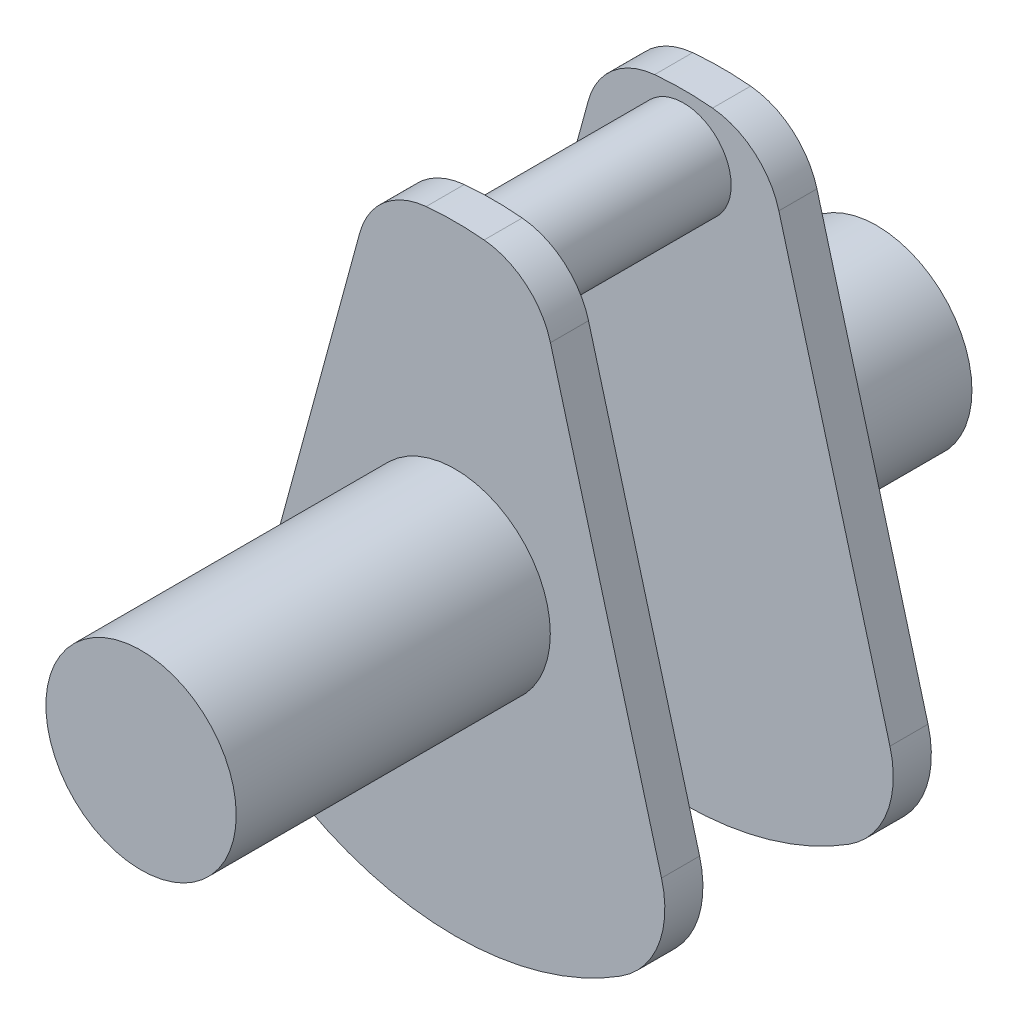
ISO-10303-21;
HEADER;
FILE_DESCRIPTION(('STEP AP214'),'2;1');
FILE_NAME('part.step','',(''),(''),'','','');
FILE_SCHEMA(('AUTOMOTIVE_DESIGN { 1 0 10303 214 1 1 1 1 }'));
ENDSEC;
DATA;
#1=APPLICATION_CONTEXT('core data for automotive mechanical design processes');
#2=APPLICATION_PROTOCOL_DEFINITION('international standard','automotive_design',2000,#1);
#3=PRODUCT_CONTEXT('',#1,'mechanical');
#4=PRODUCT('Part','Part','',(#3));
#5=PRODUCT_RELATED_PRODUCT_CATEGORY('part','',(#4));
#6=PRODUCT_DEFINITION_FORMATION('','',#4);
#7=PRODUCT_DEFINITION_CONTEXT('part definition',#1,'design');
#8=PRODUCT_DEFINITION('design','',#6,#7);
#9=PRODUCT_DEFINITION_SHAPE('','',#8);
#10=(LENGTH_UNIT() NAMED_UNIT(*) SI_UNIT(.MILLI.,.METRE.));
#11=(NAMED_UNIT(*) PLANE_ANGLE_UNIT() SI_UNIT($,.RADIAN.));
#12=(NAMED_UNIT(*) SI_UNIT($,.STERADIAN.) SOLID_ANGLE_UNIT());
#13=UNCERTAINTY_MEASURE_WITH_UNIT(LENGTH_MEASURE(1.E-05),#10,'distance_accuracy_value','');
#14=(GEOMETRIC_REPRESENTATION_CONTEXT(3) GLOBAL_UNCERTAINTY_ASSIGNED_CONTEXT((#13)) GLOBAL_UNIT_ASSIGNED_CONTEXT((#10,
#11,#12)) REPRESENTATION_CONTEXT('',''));
#15=CARTESIAN_POINT('',(0.,0.,0.));
#16=DIRECTION('',(0.,0.,1.));
#17=DIRECTION('',(1.,0.,0.));
#18=AXIS2_PLACEMENT_3D('',#15,#16,#17);
#19=CARTESIAN_POINT('',(0.459,4.87845457086565,0.8));
#20=DIRECTION('',(0.,0.,-1.));
#21=DIRECTION('',(-1.,0.,0.));
#22=AXIS2_PLACEMENT_3D('',#19,#20,#21);
#23=CYLINDRICAL_SURFACE('',#22,1.6);
#24=CARTESIAN_POINT('',(0.459,4.87845457086565,0.));
#25=DIRECTION('',(0.,0.,1.));
#26=DIRECTION('',(1.,0.,0.));
#27=AXIS2_PLACEMENT_3D('',#24,#25,#26);
#28=CIRCLE('',#27,1.6);
#29=CARTESIAN_POINT('',(2.00284320160388,5.29863092534255,0.));
#30=VERTEX_POINT('',#29);
#31=CARTESIAN_POINT('',(0.608877551020407,6.47141932869934,0.));
#32=VERTEX_POINT('',#31);
#33=EDGE_CURVE('E138',#30,#32,#28,.T.);
#34=ORIENTED_EDGE('',*,*,#33,.T.);
#35=DIRECTION('',(0.,0.,-1.));
#36=VECTOR('',#35,1.);
#37=CARTESIAN_POINT('',(0.608877551020407,6.47141932869934,0.8));
#38=LINE('',#37,#36);
#39=CARTESIAN_POINT('',(0.608877551020407,6.47141932869934,0.8));
#40=VERTEX_POINT('',#39);
#41=EDGE_CURVE('E45',#40,#32,#38,.T.);
#42=ORIENTED_EDGE('',*,*,#41,.F.);
#43=CARTESIAN_POINT('',(0.459,4.87845457086565,0.8));
#44=DIRECTION('',(0.,0.,1.));
#45=DIRECTION('',(1.,0.,0.));
#46=AXIS2_PLACEMENT_3D('',#43,#44,#45);
#47=CIRCLE('',#46,1.6);
#48=CARTESIAN_POINT('',(2.00284320160388,5.29863092534255,0.8));
#49=VERTEX_POINT('',#48);
#50=EDGE_CURVE('E153',#49,#40,#47,.T.);
#51=ORIENTED_EDGE('',*,*,#50,.F.);
#52=DIRECTION('',(0.,0.,-1.));
#53=VECTOR('',#52,1.);
#54=CARTESIAN_POINT('',(2.00284320160388,5.29863092534255,0.8));
#55=LINE('',#54,#53);
#56=EDGE_CURVE('E134',#49,#30,#55,.T.);
#57=ORIENTED_EDGE('',*,*,#56,.T.);
#58=EDGE_LOOP('',(#34,#42,#51,#57));
#59=FACE_BOUND('',#58,.T.);
#60=ADVANCED_FACE('F37',(#59),#23,.T.);
#61=CARTESIAN_POINT('',(0.,0.,0.8));
#62=DIRECTION('',(0.,0.,-1.));
#63=DIRECTION('',(-1.,0.,0.));
#64=AXIS2_PLACEMENT_3D('',#61,#62,#63);
#65=CYLINDRICAL_SURFACE('',#64,6.5);
#66=CARTESIAN_POINT('',(0.,0.,0.));
#67=DIRECTION('',(0.,0.,1.));
#68=DIRECTION('',(1.,0.,0.));
#69=AXIS2_PLACEMENT_3D('',#66,#67,#68);
#70=CIRCLE('',#69,6.5);
#71=CARTESIAN_POINT('',(-0.608877551020407,6.47141932869934,0.));
#72=VERTEX_POINT('',#71);
#73=EDGE_CURVE('E141',#32,#72,#70,.T.);
#74=ORIENTED_EDGE('',*,*,#73,.T.);
#75=DIRECTION('',(0.,0.,-1.));
#76=VECTOR('',#75,1.);
#77=CARTESIAN_POINT('',(-0.608877551020407,6.47141932869934,0.8));
#78=LINE('',#77,#76);
#79=CARTESIAN_POINT('',(-0.608877551020407,6.47141932869934,0.8));
#80=VERTEX_POINT('',#79);
#81=EDGE_CURVE('E163',#80,#72,#78,.T.);
#82=ORIENTED_EDGE('',*,*,#81,.F.);
#83=CARTESIAN_POINT('',(0.,0.,0.8));
#84=DIRECTION('',(0.,0.,1.));
#85=DIRECTION('',(1.,0.,0.));
#86=AXIS2_PLACEMENT_3D('',#83,#84,#85);
#87=CIRCLE('',#86,6.5);
#88=EDGE_CURVE('E98',#40,#80,#87,.T.);
#89=ORIENTED_EDGE('',*,*,#88,.F.);
#90=ORIENTED_EDGE('',*,*,#41,.T.);
#91=EDGE_LOOP('',(#74,#82,#89,#90));
#92=FACE_BOUND('',#91,.T.);
#93=ADVANCED_FACE('F166',(#92),#65,.T.);
#94=CARTESIAN_POINT('',(-0.459,4.87845457086565,0.8));
#95=DIRECTION('',(0.,0.,-1.));
#96=DIRECTION('',(-1.,0.,0.));
#97=AXIS2_PLACEMENT_3D('',#94,#95,#96);
#98=CYLINDRICAL_SURFACE('',#97,1.6);
#99=CARTESIAN_POINT('',(-0.459,4.87845457086565,0.));
#100=DIRECTION('',(0.,0.,1.));
#101=DIRECTION('',(-1.,0.,0.));
#102=AXIS2_PLACEMENT_3D('',#99,#100,#101);
#103=CIRCLE('',#102,1.6);
#104=CARTESIAN_POINT('',(-2.00284320160388,5.29863092534255,0.));
#105=VERTEX_POINT('',#104);
#106=EDGE_CURVE('E144',#72,#105,#103,.T.);
#107=ORIENTED_EDGE('',*,*,#106,.T.);
#108=DIRECTION('',(0.,0.,-1.));
#109=VECTOR('',#108,1.);
#110=CARTESIAN_POINT('',(-2.00284320160388,5.29863092534255,0.8));
#111=LINE('',#110,#109);
#112=CARTESIAN_POINT('',(-2.00284320160388,5.29863092534255,0.8));
#113=VERTEX_POINT('',#112);
#114=EDGE_CURVE('E160',#113,#105,#111,.T.);
#115=ORIENTED_EDGE('',*,*,#114,.F.);
#116=CARTESIAN_POINT('',(-0.459,4.87845457086565,0.8));
#117=DIRECTION('',(0.,0.,1.));
#118=DIRECTION('',(-1.,0.,0.));
#119=AXIS2_PLACEMENT_3D('',#116,#117,#118);
#120=CIRCLE('',#119,1.6);
#121=EDGE_CURVE('E184',#80,#113,#120,.T.);
#122=ORIENTED_EDGE('',*,*,#121,.F.);
#123=ORIENTED_EDGE('',*,*,#81,.T.);
#124=EDGE_LOOP('',(#107,#115,#122,#123));
#125=FACE_BOUND('',#124,.T.);
#126=ADVANCED_FACE('F177',(#125),#98,.T.);
#127=CARTESIAN_POINT('',(-2.00284320160388,5.29863092534255,0.8));
#128=DIRECTION('',(0.964902001002423,-0.26261022154806,0.));
#129=DIRECTION('',(0.26261022154806,0.964902001002423,0.));
#130=AXIS2_PLACEMENT_3D('',#127,#128,#129);
#131=PLANE('',#130);
#132=DIRECTION('',(-0.26261022154806,-0.964902001002422,0.));
#133=VECTOR('',#132,1.);
#134=CARTESIAN_POINT('',(-2.00284320160388,5.29863092534255,0.));
#135=LINE('',#134,#133);
#136=CARTESIAN_POINT('',(-4.33679216610228,-3.27693788841703,0.));
#137=VERTEX_POINT('',#136);
#138=EDGE_CURVE('E146',#105,#137,#135,.T.);
#139=ORIENTED_EDGE('',*,*,#138,.T.);
#140=DIRECTION('',(0.,0.,-1.));
#141=VECTOR('',#140,1.);
#142=CARTESIAN_POINT('',(-4.33679216610228,-3.27693788841703,0.8));
#143=LINE('',#142,#141);
#144=CARTESIAN_POINT('',(-4.33679216610228,-3.27693788841703,0.8));
#145=VERTEX_POINT('',#144);
#146=EDGE_CURVE('E157',#145,#137,#143,.T.);
#147=ORIENTED_EDGE('',*,*,#146,.F.);
#148=DIRECTION('',(-0.26261022154806,-0.964902001002422,0.));
#149=VECTOR('',#148,1.);
#150=CARTESIAN_POINT('',(-2.00284320160388,5.29863092534255,0.8));
#151=LINE('',#150,#149);
#152=EDGE_CURVE('E183',#113,#145,#151,.T.);
#153=ORIENTED_EDGE('',*,*,#152,.F.);
#154=ORIENTED_EDGE('',*,*,#114,.T.);
#155=EDGE_LOOP('',(#139,#147,#153,#154));
#156=FACE_BOUND('',#155,.T.);
#157=ADVANCED_FACE('F181',(#156),#131,.F.);
#158=CARTESIAN_POINT('',(-2.40698816409743,-3.80215833151315,0.8));
#159=DIRECTION('',(0.,0.,-1.));
#160=DIRECTION('',(-1.,0.,0.));
#161=AXIS2_PLACEMENT_3D('',#158,#159,#160);
#162=CYLINDRICAL_SURFACE('',#161,2.);
#163=CARTESIAN_POINT('',(-2.40698816409743,-3.80215833151315,0.));
#164=DIRECTION('',(0.,0.,1.));
#165=DIRECTION('',(1.,0.,0.));
#166=AXIS2_PLACEMENT_3D('',#163,#164,#165);
#167=CIRCLE('',#166,2.);
#168=CARTESIAN_POINT('',(-3.47676068147407,-5.49200647885233,0.));
#169=VERTEX_POINT('',#168);
#170=EDGE_CURVE('E148',#137,#169,#167,.T.);
#171=ORIENTED_EDGE('',*,*,#170,.T.);
#172=DIRECTION('',(0.,0.,-1.));
#173=VECTOR('',#172,1.);
#174=CARTESIAN_POINT('',(-3.47676068147407,-5.49200647885233,0.8));
#175=LINE('',#174,#173);
#176=CARTESIAN_POINT('',(-3.47676068147407,-5.49200647885233,0.8));
#177=VERTEX_POINT('',#176);
#178=EDGE_CURVE('E129',#177,#169,#175,.T.);
#179=ORIENTED_EDGE('',*,*,#178,.F.);
#180=CARTESIAN_POINT('',(-2.40698816409743,-3.80215833151315,0.8));
#181=DIRECTION('',(0.,0.,1.));
#182=DIRECTION('',(1.,0.,0.));
#183=AXIS2_PLACEMENT_3D('',#180,#181,#182);
#184=CIRCLE('',#183,2.);
#185=EDGE_CURVE('E120',#145,#177,#184,.T.);
#186=ORIENTED_EDGE('',*,*,#185,.F.);
#187=ORIENTED_EDGE('',*,*,#146,.T.);
#188=EDGE_LOOP('',(#171,#179,#186,#187));
#189=FACE_BOUND('',#188,.T.);
#190=ADVANCED_FACE('F307',(#189),#162,.T.);
#191=CARTESIAN_POINT('',(0.,0.,0.8));
#192=DIRECTION('',(0.,0.,-1.));
#193=DIRECTION('',(-1.,0.,0.));
#194=AXIS2_PLACEMENT_3D('',#191,#192,#193);
#195=CYLINDRICAL_SURFACE('',#194,6.5);
#196=CARTESIAN_POINT('',(0.,0.,0.));
#197=DIRECTION('',(0.,0.,1.));
#198=DIRECTION('',(1.,0.,0.));
#199=AXIS2_PLACEMENT_3D('',#196,#197,#198);
#200=CIRCLE('',#199,6.5);
#201=CARTESIAN_POINT('',(3.47676068147407,-5.49200647885233,0.));
#202=VERTEX_POINT('',#201);
#203=EDGE_CURVE('E128',#169,#202,#200,.T.);
#204=ORIENTED_EDGE('',*,*,#203,.T.);
#205=DIRECTION('',(0.,0.,-1.));
#206=VECTOR('',#205,1.);
#207=CARTESIAN_POINT('',(3.47676068147407,-5.49200647885233,0.8));
#208=LINE('',#207,#206);
#209=CARTESIAN_POINT('',(3.47676068147407,-5.49200647885233,0.8));
#210=VERTEX_POINT('',#209);
#211=EDGE_CURVE('E125',#210,#202,#208,.T.);
#212=ORIENTED_EDGE('',*,*,#211,.F.);
#213=CARTESIAN_POINT('',(0.,0.,0.8));
#214=DIRECTION('',(0.,0.,1.));
#215=DIRECTION('',(1.,0.,0.));
#216=AXIS2_PLACEMENT_3D('',#213,#214,#215);
#217=CIRCLE('',#216,6.5);
#218=EDGE_CURVE('E114',#177,#210,#217,.T.);
#219=ORIENTED_EDGE('',*,*,#218,.F.);
#220=ORIENTED_EDGE('',*,*,#178,.T.);
#221=EDGE_LOOP('',(#204,#212,#219,#220));
#222=FACE_BOUND('',#221,.T.);
#223=ADVANCED_FACE('F126',(#222),#195,.T.);
#224=CARTESIAN_POINT('',(2.40698816409743,-3.80215833151315,0.8));
#225=DIRECTION('',(0.,0.,-1.));
#226=DIRECTION('',(-1.,0.,0.));
#227=AXIS2_PLACEMENT_3D('',#224,#225,#226);
#228=CYLINDRICAL_SURFACE('',#227,2.);
#229=CARTESIAN_POINT('',(2.40698816409743,-3.80215833151315,0.));
#230=DIRECTION('',(0.,0.,1.));
#231=DIRECTION('',(1.,0.,0.));
#232=AXIS2_PLACEMENT_3D('',#229,#230,#231);
#233=CIRCLE('',#232,2.);
#234=CARTESIAN_POINT('',(4.33679216610228,-3.27693788841703,0.));
#235=VERTEX_POINT('',#234);
#236=EDGE_CURVE('E83',#202,#235,#233,.T.);
#237=ORIENTED_EDGE('',*,*,#236,.T.);
#238=DIRECTION('',(0.,0.,-1.));
#239=VECTOR('',#238,1.);
#240=CARTESIAN_POINT('',(4.33679216610228,-3.27693788841703,0.8));
#241=LINE('',#240,#239);
#242=CARTESIAN_POINT('',(4.33679216610228,-3.27693788841703,0.8));
#243=VERTEX_POINT('',#242);
#244=EDGE_CURVE('E130',#243,#235,#241,.T.);
#245=ORIENTED_EDGE('',*,*,#244,.F.);
#246=CARTESIAN_POINT('',(2.40698816409743,-3.80215833151315,0.8));
#247=DIRECTION('',(0.,0.,1.));
#248=DIRECTION('',(1.,0.,0.));
#249=AXIS2_PLACEMENT_3D('',#246,#247,#248);
#250=CIRCLE('',#249,2.);
#251=EDGE_CURVE('E118',#210,#243,#250,.T.);
#252=ORIENTED_EDGE('',*,*,#251,.F.);
#253=ORIENTED_EDGE('',*,*,#211,.T.);
#254=EDGE_LOOP('',(#237,#245,#252,#253));
#255=FACE_BOUND('',#254,.T.);
#256=ADVANCED_FACE('F132',(#255),#228,.T.);
#257=CARTESIAN_POINT('',(2.00284320160388,5.29863092534255,0.8));
#258=DIRECTION('',(-0.964902001002422,-0.26261022154806,0.));
#259=DIRECTION('',(0.26261022154806,-0.964902001002422,0.));
#260=AXIS2_PLACEMENT_3D('',#257,#258,#259);
#261=PLANE('',#260);
#262=DIRECTION('',(-0.26261022154806,0.964902001002422,0.));
#263=VECTOR('',#262,1.);
#264=CARTESIAN_POINT('',(2.00284320160388,5.29863092534255,0.));
#265=LINE('',#264,#263);
#266=EDGE_CURVE('E89',#235,#30,#265,.T.);
#267=ORIENTED_EDGE('',*,*,#266,.T.);
#268=ORIENTED_EDGE('',*,*,#56,.F.);
#269=DIRECTION('',(-0.26261022154806,0.964902001002422,0.));
#270=VECTOR('',#269,1.);
#271=CARTESIAN_POINT('',(2.00284320160388,5.29863092534255,0.8));
#272=LINE('',#271,#270);
#273=EDGE_CURVE('E53',#243,#49,#272,.T.);
#274=ORIENTED_EDGE('',*,*,#273,.F.);
#275=ORIENTED_EDGE('',*,*,#244,.T.);
#276=EDGE_LOOP('',(#267,#268,#274,#275));
#277=FACE_BOUND('',#276,.T.);
#278=ADVANCED_FACE('F315',(#277),#261,.F.);
#279=CARTESIAN_POINT('',(0.459,4.87845457086565,0.8));
#280=DIRECTION('',(0.,0.,1.));
#281=DIRECTION('',(1.,0.,0.));
#282=AXIS2_PLACEMENT_3D('',#279,#280,#281);
#283=PLANE('',#282);
#284=CARTESIAN_POINT('',(0.,5.26,0.8));
#285=DIRECTION('',(0.,0.,1.));
#286=DIRECTION('',(1.,0.,0.));
#287=AXIS2_PLACEMENT_3D('',#284,#285,#286);
#288=CIRCLE('',#287,1.);
#289=CARTESIAN_POINT('',(1.,5.26,0.8));
#290=VERTEX_POINT('',#289);
#291=EDGE_CURVE('E142',#290,#290,#288,.T.);
#292=ORIENTED_EDGE('',*,*,#291,.F.);
#293=EDGE_LOOP('',(#292));
#294=FACE_BOUND('',#293,.T.);
#295=ORIENTED_EDGE('',*,*,#50,.T.);
#296=ORIENTED_EDGE('',*,*,#88,.T.);
#297=ORIENTED_EDGE('',*,*,#121,.T.);
#298=ORIENTED_EDGE('',*,*,#152,.T.);
#299=ORIENTED_EDGE('',*,*,#185,.T.);
#300=ORIENTED_EDGE('',*,*,#218,.T.);
#301=ORIENTED_EDGE('',*,*,#251,.T.);
#302=ORIENTED_EDGE('',*,*,#273,.T.);
#303=EDGE_LOOP('',(#295,#296,#297,#298,#299,#300,#301,#302));
#304=FACE_BOUND('',#303,.T.);
#305=ADVANCED_FACE('F116',(#294,#304),#283,.T.);
#306=CARTESIAN_POINT('',(0.459,4.87845457086565,0.));
#307=DIRECTION('',(0.,0.,1.));
#308=DIRECTION('',(1.,0.,0.));
#309=AXIS2_PLACEMENT_3D('',#306,#307,#308);
#310=PLANE('',#309);
#311=CARTESIAN_POINT('',(0.,0.,0.));
#312=DIRECTION('',(0.,0.,1.));
#313=DIRECTION('',(1.,0.,0.));
#314=AXIS2_PLACEMENT_3D('',#311,#312,#313);
#315=CIRCLE('',#314,2.);
#316=CARTESIAN_POINT('',(2.,0.,0.));
#317=VERTEX_POINT('',#316);
#318=EDGE_CURVE('E11',#317,#317,#315,.F.);
#319=ORIENTED_EDGE('',*,*,#318,.F.);
#320=EDGE_LOOP('',(#319));
#321=FACE_BOUND('',#320,.T.);
#322=ORIENTED_EDGE('',*,*,#33,.F.);
#323=ORIENTED_EDGE('',*,*,#266,.F.);
#324=ORIENTED_EDGE('',*,*,#236,.F.);
#325=ORIENTED_EDGE('',*,*,#203,.F.);
#326=ORIENTED_EDGE('',*,*,#170,.F.);
#327=ORIENTED_EDGE('',*,*,#138,.F.);
#328=ORIENTED_EDGE('',*,*,#106,.F.);
#329=ORIENTED_EDGE('',*,*,#73,.F.);
#330=EDGE_LOOP('',(#322,#323,#324,#325,#326,#327,#328,#329));
#331=FACE_BOUND('',#330,.T.);
#332=ADVANCED_FACE('F171',(#321,#331),#310,.F.);
#333=CARTESIAN_POINT('',(0.,5.26,2.8));
#334=DIRECTION('',(0.,0.,-1.));
#335=DIRECTION('',(-1.,0.,0.));
#336=AXIS2_PLACEMENT_3D('',#333,#334,#335);
#337=CYLINDRICAL_SURFACE('',#336,1.);
#338=ORIENTED_EDGE('',*,*,#291,.T.);
#339=EDGE_LOOP('',(#338));
#340=FACE_BOUND('',#339,.T.);
#341=CARTESIAN_POINT('',(0.,5.26,4.8));
#342=DIRECTION('',(0.,0.,1.));
#343=DIRECTION('',(1.,0.,0.));
#344=AXIS2_PLACEMENT_3D('',#341,#342,#343);
#345=CIRCLE('',#344,1.);
#346=CARTESIAN_POINT('',(1.,5.26,4.8));
#347=VERTEX_POINT('',#346);
#348=EDGE_CURVE('E248',#347,#347,#345,.T.);
#349=ORIENTED_EDGE('',*,*,#348,.F.);
#350=EDGE_LOOP('',(#349));
#351=FACE_BOUND('',#350,.T.);
#352=ADVANCED_FACE('F320',(#340,#351),#337,.T.);
#353=CARTESIAN_POINT('',(0.,0.,-3.26));
#354=DIRECTION('',(0.,0.,1.));
#355=DIRECTION('',(1.,0.,0.));
#356=AXIS2_PLACEMENT_3D('',#353,#354,#355);
#357=CYLINDRICAL_SURFACE('',#356,2.);
#358=CARTESIAN_POINT('',(0.,0.,-3.26));
#359=DIRECTION('',(0.,0.,-1.));
#360=DIRECTION('',(-1.,0.,0.));
#361=AXIS2_PLACEMENT_3D('',#358,#359,#360);
#362=CIRCLE('',#361,2.);
#363=CARTESIAN_POINT('',(-2.,0.,-3.26));
#364=VERTEX_POINT('',#363);
#365=EDGE_CURVE('E192',#364,#364,#362,.T.);
#366=ORIENTED_EDGE('',*,*,#365,.F.);
#367=EDGE_LOOP('',(#366));
#368=FACE_BOUND('',#367,.T.);
#369=ORIENTED_EDGE('',*,*,#318,.T.);
#370=EDGE_LOOP('',(#369));
#371=FACE_BOUND('',#370,.T.);
#372=ADVANCED_FACE('F326',(#368,#371),#357,.T.);
#373=CARTESIAN_POINT('',(0.,0.,-3.26));
#374=DIRECTION('',(0.,0.,-1.));
#375=DIRECTION('',(-1.,0.,0.));
#376=AXIS2_PLACEMENT_3D('',#373,#374,#375);
#377=PLANE('',#376);
#378=ORIENTED_EDGE('',*,*,#365,.T.);
#379=EDGE_LOOP('',(#378));
#380=FACE_BOUND('',#379,.T.);
#381=ADVANCED_FACE('F330',(#380),#377,.T.);
#382=CARTESIAN_POINT('',(0.459,4.87845457086565,4.8));
#383=DIRECTION('',(0.,0.,1.));
#384=DIRECTION('',(-1.,0.,0.));
#385=AXIS2_PLACEMENT_3D('',#382,#383,#384);
#386=CYLINDRICAL_SURFACE('',#385,1.6);
#387=CARTESIAN_POINT('',(0.459,4.87845457086565,5.6));
#388=DIRECTION('',(0.,0.,1.));
#389=DIRECTION('',(1.,0.,0.));
#390=AXIS2_PLACEMENT_3D('',#387,#388,#389);
#391=CIRCLE('',#390,1.6);
#392=CARTESIAN_POINT('',(2.00284320160388,5.29863092534255,5.6));
#393=VERTEX_POINT('',#392);
#394=CARTESIAN_POINT('',(0.608877551020407,6.47141932869934,5.6));
#395=VERTEX_POINT('',#394);
#396=EDGE_CURVE('E245',#393,#395,#391,.T.);
#397=ORIENTED_EDGE('',*,*,#396,.F.);
#398=DIRECTION('',(0.,0.,1.));
#399=VECTOR('',#398,1.);
#400=CARTESIAN_POINT('',(2.00284320160388,5.29863092534255,4.8));
#401=LINE('',#400,#399);
#402=CARTESIAN_POINT('',(2.00284320160388,5.29863092534255,4.8));
#403=VERTEX_POINT('',#402);
#404=EDGE_CURVE('E219',#403,#393,#401,.T.);
#405=ORIENTED_EDGE('',*,*,#404,.F.);
#406=CARTESIAN_POINT('',(0.459,4.87845457086565,4.8));
#407=DIRECTION('',(0.,0.,1.));
#408=DIRECTION('',(1.,0.,0.));
#409=AXIS2_PLACEMENT_3D('',#406,#407,#408);
#410=CIRCLE('',#409,1.6);
#411=CARTESIAN_POINT('',(0.608877551020407,6.47141932869934,4.8));
#412=VERTEX_POINT('',#411);
#413=EDGE_CURVE('E226',#403,#412,#410,.T.);
#414=ORIENTED_EDGE('',*,*,#413,.T.);
#415=DIRECTION('',(0.,0.,1.));
#416=VECTOR('',#415,1.);
#417=CARTESIAN_POINT('',(0.608877551020407,6.47141932869934,4.8));
#418=LINE('',#417,#416);
#419=EDGE_CURVE('E198',#412,#395,#418,.T.);
#420=ORIENTED_EDGE('',*,*,#419,.T.);
#421=EDGE_LOOP('',(#397,#405,#414,#420));
#422=FACE_BOUND('',#421,.T.);
#423=ADVANCED_FACE('F333',(#422),#386,.T.);
#424=CARTESIAN_POINT('',(0.,0.,4.8));
#425=DIRECTION('',(0.,0.,1.));
#426=DIRECTION('',(-1.,0.,0.));
#427=AXIS2_PLACEMENT_3D('',#424,#425,#426);
#428=CYLINDRICAL_SURFACE('',#427,6.5);
#429=CARTESIAN_POINT('',(0.,0.,5.6));
#430=DIRECTION('',(0.,0.,1.));
#431=DIRECTION('',(1.,0.,0.));
#432=AXIS2_PLACEMENT_3D('',#429,#430,#431);
#433=CIRCLE('',#432,6.5);
#434=CARTESIAN_POINT('',(-0.608877551020407,6.47141932869934,5.6));
#435=VERTEX_POINT('',#434);
#436=EDGE_CURVE('E242',#395,#435,#433,.T.);
#437=ORIENTED_EDGE('',*,*,#436,.F.);
#438=ORIENTED_EDGE('',*,*,#419,.F.);
#439=CARTESIAN_POINT('',(0.,0.,4.8));
#440=DIRECTION('',(0.,0.,1.));
#441=DIRECTION('',(1.,0.,0.));
#442=AXIS2_PLACEMENT_3D('',#439,#440,#441);
#443=CIRCLE('',#442,6.5);
#444=CARTESIAN_POINT('',(-0.608877551020407,6.47141932869934,4.8));
#445=VERTEX_POINT('',#444);
#446=EDGE_CURVE('E266',#412,#445,#443,.T.);
#447=ORIENTED_EDGE('',*,*,#446,.T.);
#448=DIRECTION('',(0.,0.,1.));
#449=VECTOR('',#448,1.);
#450=CARTESIAN_POINT('',(-0.608877551020407,6.47141932869934,4.8));
#451=LINE('',#450,#449);
#452=EDGE_CURVE('E201',#445,#435,#451,.T.);
#453=ORIENTED_EDGE('',*,*,#452,.T.);
#454=EDGE_LOOP('',(#437,#438,#447,#453));
#455=FACE_BOUND('',#454,.T.);
#456=ADVANCED_FACE('F337',(#455),#428,.T.);
#457=CARTESIAN_POINT('',(-0.459,4.87845457086565,4.8));
#458=DIRECTION('',(0.,0.,1.));
#459=DIRECTION('',(-1.,0.,0.));
#460=AXIS2_PLACEMENT_3D('',#457,#458,#459);
#461=CYLINDRICAL_SURFACE('',#460,1.6);
#462=CARTESIAN_POINT('',(-0.459,4.87845457086565,5.6));
#463=DIRECTION('',(0.,0.,1.));
#464=DIRECTION('',(-1.,0.,0.));
#465=AXIS2_PLACEMENT_3D('',#462,#463,#464);
#466=CIRCLE('',#465,1.6);
#467=CARTESIAN_POINT('',(-2.00284320160388,5.29863092534255,5.6));
#468=VERTEX_POINT('',#467);
#469=EDGE_CURVE('E239',#435,#468,#466,.T.);
#470=ORIENTED_EDGE('',*,*,#469,.F.);
#471=ORIENTED_EDGE('',*,*,#452,.F.);
#472=CARTESIAN_POINT('',(-0.459,4.87845457086565,4.8));
#473=DIRECTION('',(0.,0.,1.));
#474=DIRECTION('',(-1.,0.,0.));
#475=AXIS2_PLACEMENT_3D('',#472,#473,#474);
#476=CIRCLE('',#475,1.6);
#477=CARTESIAN_POINT('',(-2.00284320160388,5.29863092534255,4.8));
#478=VERTEX_POINT('',#477);
#479=EDGE_CURVE('E263',#445,#478,#476,.T.);
#480=ORIENTED_EDGE('',*,*,#479,.T.);
#481=DIRECTION('',(0.,0.,1.));
#482=VECTOR('',#481,1.);
#483=CARTESIAN_POINT('',(-2.00284320160388,5.29863092534255,4.8));
#484=LINE('',#483,#482);
#485=EDGE_CURVE('E204',#478,#468,#484,.T.);
#486=ORIENTED_EDGE('',*,*,#485,.T.);
#487=EDGE_LOOP('',(#470,#471,#480,#486));
#488=FACE_BOUND('',#487,.T.);
#489=ADVANCED_FACE('F341',(#488),#461,.T.);
#490=CARTESIAN_POINT('',(-2.00284320160388,5.29863092534255,4.8));
#491=DIRECTION('',(0.964902001002423,-0.26261022154806,0.));
#492=DIRECTION('',(0.26261022154806,0.964902001002423,0.));
#493=AXIS2_PLACEMENT_3D('',#490,#491,#492);
#494=PLANE('',#493);
#495=DIRECTION('',(-0.26261022154806,-0.964902001002422,0.));
#496=VECTOR('',#495,1.);
#497=CARTESIAN_POINT('',(-2.00284320160388,5.29863092534255,5.6));
#498=LINE('',#497,#496);
#499=CARTESIAN_POINT('',(-4.33679216610228,-3.27693788841703,5.6));
#500=VERTEX_POINT('',#499);
#501=EDGE_CURVE('E236',#468,#500,#498,.T.);
#502=ORIENTED_EDGE('',*,*,#501,.F.);
#503=ORIENTED_EDGE('',*,*,#485,.F.);
#504=DIRECTION('',(-0.26261022154806,-0.964902001002422,0.));
#505=VECTOR('',#504,1.);
#506=CARTESIAN_POINT('',(-2.00284320160388,5.29863092534255,4.8));
#507=LINE('',#506,#505);
#508=CARTESIAN_POINT('',(-4.33679216610228,-3.27693788841703,4.8));
#509=VERTEX_POINT('',#508);
#510=EDGE_CURVE('E260',#478,#509,#507,.T.);
#511=ORIENTED_EDGE('',*,*,#510,.T.);
#512=DIRECTION('',(0.,0.,1.));
#513=VECTOR('',#512,1.);
#514=CARTESIAN_POINT('',(-4.33679216610228,-3.27693788841703,4.8));
#515=LINE('',#514,#513);
#516=EDGE_CURVE('E207',#509,#500,#515,.T.);
#517=ORIENTED_EDGE('',*,*,#516,.T.);
#518=EDGE_LOOP('',(#502,#503,#511,#517));
#519=FACE_BOUND('',#518,.T.);
#520=ADVANCED_FACE('F345',(#519),#494,.F.);
#521=CARTESIAN_POINT('',(-2.40698816409743,-3.80215833151315,4.8));
#522=DIRECTION('',(0.,0.,1.));
#523=DIRECTION('',(-1.,0.,0.));
#524=AXIS2_PLACEMENT_3D('',#521,#522,#523);
#525=CYLINDRICAL_SURFACE('',#524,2.);
#526=CARTESIAN_POINT('',(-2.40698816409743,-3.80215833151315,5.6));
#527=DIRECTION('',(0.,0.,1.));
#528=DIRECTION('',(1.,0.,0.));
#529=AXIS2_PLACEMENT_3D('',#526,#527,#528);
#530=CIRCLE('',#529,2.);
#531=CARTESIAN_POINT('',(-3.47676068147407,-5.49200647885233,5.6));
#532=VERTEX_POINT('',#531);
#533=EDGE_CURVE('E233',#500,#532,#530,.T.);
#534=ORIENTED_EDGE('',*,*,#533,.F.);
#535=ORIENTED_EDGE('',*,*,#516,.F.);
#536=CARTESIAN_POINT('',(-2.40698816409743,-3.80215833151315,4.8));
#537=DIRECTION('',(0.,0.,1.));
#538=DIRECTION('',(1.,0.,0.));
#539=AXIS2_PLACEMENT_3D('',#536,#537,#538);
#540=CIRCLE('',#539,2.);
#541=CARTESIAN_POINT('',(-3.47676068147407,-5.49200647885233,4.8));
#542=VERTEX_POINT('',#541);
#543=EDGE_CURVE('E257',#509,#542,#540,.T.);
#544=ORIENTED_EDGE('',*,*,#543,.T.);
#545=DIRECTION('',(0.,0.,1.));
#546=VECTOR('',#545,1.);
#547=CARTESIAN_POINT('',(-3.47676068147407,-5.49200647885233,4.8));
#548=LINE('',#547,#546);
#549=EDGE_CURVE('E210',#542,#532,#548,.T.);
#550=ORIENTED_EDGE('',*,*,#549,.T.);
#551=EDGE_LOOP('',(#534,#535,#544,#550));
#552=FACE_BOUND('',#551,.T.);
#553=ADVANCED_FACE('F349',(#552),#525,.T.);
#554=CARTESIAN_POINT('',(0.,0.,4.8));
#555=DIRECTION('',(0.,0.,1.));
#556=DIRECTION('',(-1.,0.,0.));
#557=AXIS2_PLACEMENT_3D('',#554,#555,#556);
#558=CYLINDRICAL_SURFACE('',#557,6.5);
#559=CARTESIAN_POINT('',(0.,0.,5.6));
#560=DIRECTION('',(0.,0.,1.));
#561=DIRECTION('',(1.,0.,0.));
#562=AXIS2_PLACEMENT_3D('',#559,#560,#561);
#563=CIRCLE('',#562,6.5);
#564=CARTESIAN_POINT('',(3.47676068147407,-5.49200647885233,5.6));
#565=VERTEX_POINT('',#564);
#566=EDGE_CURVE('E230',#532,#565,#563,.T.);
#567=ORIENTED_EDGE('',*,*,#566,.F.);
#568=ORIENTED_EDGE('',*,*,#549,.F.);
#569=CARTESIAN_POINT('',(0.,0.,4.8));
#570=DIRECTION('',(0.,0.,1.));
#571=DIRECTION('',(1.,0.,0.));
#572=AXIS2_PLACEMENT_3D('',#569,#570,#571);
#573=CIRCLE('',#572,6.5);
#574=CARTESIAN_POINT('',(3.47676068147407,-5.49200647885233,4.8));
#575=VERTEX_POINT('',#574);
#576=EDGE_CURVE('E254',#542,#575,#573,.T.);
#577=ORIENTED_EDGE('',*,*,#576,.T.);
#578=DIRECTION('',(0.,0.,1.));
#579=VECTOR('',#578,1.);
#580=CARTESIAN_POINT('',(3.47676068147407,-5.49200647885233,4.8));
#581=LINE('',#580,#579);
#582=EDGE_CURVE('E213',#575,#565,#581,.T.);
#583=ORIENTED_EDGE('',*,*,#582,.T.);
#584=EDGE_LOOP('',(#567,#568,#577,#583));
#585=FACE_BOUND('',#584,.T.);
#586=ADVANCED_FACE('F353',(#585),#558,.T.);
#587=CARTESIAN_POINT('',(2.40698816409743,-3.80215833151315,4.8));
#588=DIRECTION('',(0.,0.,1.));
#589=DIRECTION('',(-1.,0.,0.));
#590=AXIS2_PLACEMENT_3D('',#587,#588,#589);
#591=CYLINDRICAL_SURFACE('',#590,2.);
#592=CARTESIAN_POINT('',(2.40698816409743,-3.80215833151315,5.6));
#593=DIRECTION('',(0.,0.,1.));
#594=DIRECTION('',(1.,0.,0.));
#595=AXIS2_PLACEMENT_3D('',#592,#593,#594);
#596=CIRCLE('',#595,2.);
#597=CARTESIAN_POINT('',(4.33679216610228,-3.27693788841703,5.6));
#598=VERTEX_POINT('',#597);
#599=EDGE_CURVE('E227',#565,#598,#596,.T.);
#600=ORIENTED_EDGE('',*,*,#599,.F.);
#601=ORIENTED_EDGE('',*,*,#582,.F.);
#602=CARTESIAN_POINT('',(2.40698816409743,-3.80215833151315,4.8));
#603=DIRECTION('',(0.,0.,1.));
#604=DIRECTION('',(1.,0.,0.));
#605=AXIS2_PLACEMENT_3D('',#602,#603,#604);
#606=CIRCLE('',#605,2.);
#607=CARTESIAN_POINT('',(4.33679216610228,-3.27693788841703,4.8));
#608=VERTEX_POINT('',#607);
#609=EDGE_CURVE('E251',#575,#608,#606,.T.);
#610=ORIENTED_EDGE('',*,*,#609,.T.);
#611=DIRECTION('',(0.,0.,1.));
#612=VECTOR('',#611,1.);
#613=CARTESIAN_POINT('',(4.33679216610228,-3.27693788841703,4.8));
#614=LINE('',#613,#612);
#615=EDGE_CURVE('E216',#608,#598,#614,.T.);
#616=ORIENTED_EDGE('',*,*,#615,.T.);
#617=EDGE_LOOP('',(#600,#601,#610,#616));
#618=FACE_BOUND('',#617,.T.);
#619=ADVANCED_FACE('F357',(#618),#591,.T.);
#620=CARTESIAN_POINT('',(2.00284320160388,5.29863092534255,4.8));
#621=DIRECTION('',(-0.964902001002422,-0.26261022154806,0.));
#622=DIRECTION('',(0.26261022154806,-0.964902001002422,0.));
#623=AXIS2_PLACEMENT_3D('',#620,#621,#622);
#624=PLANE('',#623);
#625=DIRECTION('',(-0.26261022154806,0.964902001002422,0.));
#626=VECTOR('',#625,1.);
#627=CARTESIAN_POINT('',(2.00284320160388,5.29863092534255,5.6));
#628=LINE('',#627,#626);
#629=EDGE_CURVE('E223',#598,#393,#628,.T.);
#630=ORIENTED_EDGE('',*,*,#629,.F.);
#631=ORIENTED_EDGE('',*,*,#615,.F.);
#632=DIRECTION('',(-0.26261022154806,0.964902001002422,0.));
#633=VECTOR('',#632,1.);
#634=CARTESIAN_POINT('',(2.00284320160388,5.29863092534255,4.8));
#635=LINE('',#634,#633);
#636=EDGE_CURVE('E222',#608,#403,#635,.T.);
#637=ORIENTED_EDGE('',*,*,#636,.T.);
#638=ORIENTED_EDGE('',*,*,#404,.T.);
#639=EDGE_LOOP('',(#630,#631,#637,#638));
#640=FACE_BOUND('',#639,.T.);
#641=ADVANCED_FACE('F361',(#640),#624,.F.);
#642=CARTESIAN_POINT('',(0.459,4.87845457086565,4.8));
#643=DIRECTION('',(0.,0.,-1.));
#644=DIRECTION('',(1.,0.,0.));
#645=AXIS2_PLACEMENT_3D('',#642,#643,#644);
#646=PLANE('',#645);
#647=ORIENTED_EDGE('',*,*,#348,.T.);
#648=EDGE_LOOP('',(#647));
#649=FACE_BOUND('',#648,.T.);
#650=ORIENTED_EDGE('',*,*,#413,.F.);
#651=ORIENTED_EDGE('',*,*,#636,.F.);
#652=ORIENTED_EDGE('',*,*,#609,.F.);
#653=ORIENTED_EDGE('',*,*,#576,.F.);
#654=ORIENTED_EDGE('',*,*,#543,.F.);
#655=ORIENTED_EDGE('',*,*,#510,.F.);
#656=ORIENTED_EDGE('',*,*,#479,.F.);
#657=ORIENTED_EDGE('',*,*,#446,.F.);
#658=EDGE_LOOP('',(#650,#651,#652,#653,#654,#655,#656,#657));
#659=FACE_BOUND('',#658,.T.);
#660=ADVANCED_FACE('F290',(#649,#659),#646,.T.);
#661=CARTESIAN_POINT('',(0.459,4.87845457086565,5.6));
#662=DIRECTION('',(0.,0.,-1.));
#663=DIRECTION('',(1.,0.,0.));
#664=AXIS2_PLACEMENT_3D('',#661,#662,#663);
#665=PLANE('',#664);
#666=CARTESIAN_POINT('',(0.,0.,5.6));
#667=DIRECTION('',(0.,0.,1.));
#668=DIRECTION('',(1.,0.,0.));
#669=AXIS2_PLACEMENT_3D('',#666,#667,#668);
#670=CIRCLE('',#669,2.);
#671=CARTESIAN_POINT('',(2.,0.,5.6));
#672=VERTEX_POINT('',#671);
#673=EDGE_CURVE('E195',#672,#672,#670,.F.);
#674=ORIENTED_EDGE('',*,*,#673,.T.);
#675=EDGE_LOOP('',(#674));
#676=FACE_BOUND('',#675,.T.);
#677=ORIENTED_EDGE('',*,*,#396,.T.);
#678=ORIENTED_EDGE('',*,*,#436,.T.);
#679=ORIENTED_EDGE('',*,*,#469,.T.);
#680=ORIENTED_EDGE('',*,*,#501,.T.);
#681=ORIENTED_EDGE('',*,*,#533,.T.);
#682=ORIENTED_EDGE('',*,*,#566,.T.);
#683=ORIENTED_EDGE('',*,*,#599,.T.);
#684=ORIENTED_EDGE('',*,*,#629,.T.);
#685=EDGE_LOOP('',(#677,#678,#679,#680,#681,#682,#683,#684));
#686=FACE_BOUND('',#685,.T.);
#687=ADVANCED_FACE('F281',(#676,#686),#665,.F.);
#688=CARTESIAN_POINT('',(0.,0.,8.86));
#689=DIRECTION('',(0.,0.,-1.));
#690=DIRECTION('',(1.,0.,0.));
#691=AXIS2_PLACEMENT_3D('',#688,#689,#690);
#692=CYLINDRICAL_SURFACE('',#691,2.);
#693=ORIENTED_EDGE('',*,*,#673,.F.);
#694=EDGE_LOOP('',(#693));
#695=FACE_BOUND('',#694,.T.);
#696=CARTESIAN_POINT('',(0.,0.,12.2));
#697=DIRECTION('',(0.,0.,1.));
#698=DIRECTION('',(1.,0.,0.));
#699=AXIS2_PLACEMENT_3D('',#696,#697,#698);
#700=CIRCLE('',#699,2.);
#701=CARTESIAN_POINT('',(2.,0.,12.2));
#702=VERTEX_POINT('',#701);
#703=EDGE_CURVE('E273',#702,#702,#700,.T.);
#704=ORIENTED_EDGE('',*,*,#703,.F.);
#705=EDGE_LOOP('',(#704));
#706=FACE_BOUND('',#705,.T.);
#707=ADVANCED_FACE('F279',(#695,#706),#692,.T.);
#708=CARTESIAN_POINT('',(0.,0.,12.2));
#709=DIRECTION('',(0.,0.,1.));
#710=DIRECTION('',(1.,0.,0.));
#711=AXIS2_PLACEMENT_3D('',#708,#709,#710);
#712=PLANE('',#711);
#713=ORIENTED_EDGE('',*,*,#703,.T.);
#714=EDGE_LOOP('',(#713));
#715=FACE_BOUND('',#714,.T.);
#716=ADVANCED_FACE('F277',(#715),#712,.T.);
#717=CLOSED_SHELL('',(#60,#93,#126,#157,#190,#223,#256,#278,#305,#332,#352,#372,#381,#423,#456,
#489,#520,#553,#586,#619,#641,#660,#687,#707,#716));
#718=MANIFOLD_SOLID_BREP('B2',#717);
#719=ADVANCED_BREP_SHAPE_REPRESENTATION('',(#18,#718),#14);
#720=SHAPE_DEFINITION_REPRESENTATION(#9,#719);
ENDSEC;
END-ISO-10303-21;
